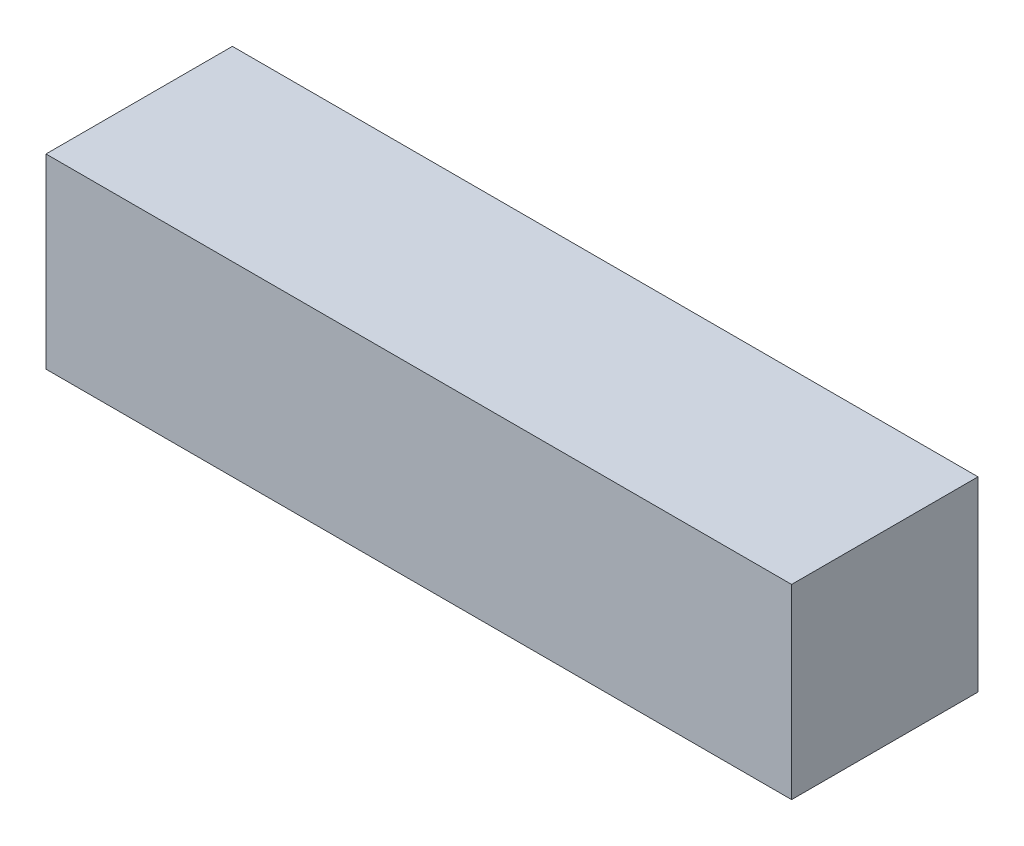
ISO-10303-21;
HEADER;
FILE_DESCRIPTION(('STEP AP214'),'2;1');
FILE_NAME('part.step','',(''),(''),'','','');
FILE_SCHEMA(('AUTOMOTIVE_DESIGN { 1 0 10303 214 1 1 1 1 }'));
ENDSEC;
DATA;
#1=APPLICATION_CONTEXT('core data for automotive mechanical design processes');
#2=APPLICATION_PROTOCOL_DEFINITION('international standard','automotive_design',2000,#1);
#3=PRODUCT_CONTEXT('',#1,'mechanical');
#4=PRODUCT('Part','Part','',(#3));
#5=PRODUCT_RELATED_PRODUCT_CATEGORY('part','',(#4));
#6=PRODUCT_DEFINITION_FORMATION('','',#4);
#7=PRODUCT_DEFINITION_CONTEXT('part definition',#1,'design');
#8=PRODUCT_DEFINITION('design','',#6,#7);
#9=PRODUCT_DEFINITION_SHAPE('','',#8);
#10=(LENGTH_UNIT() NAMED_UNIT(*) SI_UNIT(.MILLI.,.METRE.));
#11=(NAMED_UNIT(*) PLANE_ANGLE_UNIT() SI_UNIT($,.RADIAN.));
#12=(NAMED_UNIT(*) SI_UNIT($,.STERADIAN.) SOLID_ANGLE_UNIT());
#13=UNCERTAINTY_MEASURE_WITH_UNIT(LENGTH_MEASURE(1.E-05),#10,'distance_accuracy_value','');
#14=(GEOMETRIC_REPRESENTATION_CONTEXT(3) GLOBAL_UNCERTAINTY_ASSIGNED_CONTEXT((#13)) GLOBAL_UNIT_ASSIGNED_CONTEXT((#10,
#11,#12)) REPRESENTATION_CONTEXT('',''));
#15=CARTESIAN_POINT('',(0.,0.,0.));
#16=DIRECTION('',(0.,0.,1.));
#17=DIRECTION('',(1.,0.,0.));
#18=AXIS2_PLACEMENT_3D('',#15,#16,#17);
#19=CARTESIAN_POINT('',(19.05,4.7625,-4.7625));
#20=DIRECTION('',(0.,0.,1.));
#21=DIRECTION('',(-1.,0.,0.));
#22=AXIS2_PLACEMENT_3D('',#19,#20,#21);
#23=PLANE('',#22);
#24=DIRECTION('',(0.,-1.,0.));
#25=VECTOR('',#24,1.);
#26=CARTESIAN_POINT('',(-19.05,4.7625,-4.7625));
#27=LINE('',#26,#25);
#28=CARTESIAN_POINT('',(-19.05,4.7625,-4.7625));
#29=VERTEX_POINT('',#28);
#30=CARTESIAN_POINT('',(-19.05,-4.7625,-4.7625));
#31=VERTEX_POINT('',#30);
#32=EDGE_CURVE('E104',#29,#31,#27,.T.);
#33=ORIENTED_EDGE('',*,*,#32,.F.);
#34=DIRECTION('',(-1.,0.,0.));
#35=VECTOR('',#34,1.);
#36=CARTESIAN_POINT('',(19.05,4.7625,-4.7625));
#37=LINE('',#36,#35);
#38=CARTESIAN_POINT('',(19.05,4.7625,-4.7625));
#39=VERTEX_POINT('',#38);
#40=EDGE_CURVE('E103',#39,#29,#37,.T.);
#41=ORIENTED_EDGE('',*,*,#40,.F.);
#42=DIRECTION('',(0.,-1.,0.));
#43=VECTOR('',#42,1.);
#44=CARTESIAN_POINT('',(19.05,4.7625,-4.7625));
#45=LINE('',#44,#43);
#46=CARTESIAN_POINT('',(19.05,-4.7625,-4.7625));
#47=VERTEX_POINT('',#46);
#48=EDGE_CURVE('E98',#39,#47,#45,.T.);
#49=ORIENTED_EDGE('',*,*,#48,.T.);
#50=DIRECTION('',(-1.,0.,0.));
#51=VECTOR('',#50,1.);
#52=CARTESIAN_POINT('',(19.05,-4.7625,-4.7625));
#53=LINE('',#52,#51);
#54=EDGE_CURVE('E11',#47,#31,#53,.T.);
#55=ORIENTED_EDGE('',*,*,#54,.T.);
#56=EDGE_LOOP('',(#33,#41,#49,#55));
#57=FACE_BOUND('',#56,.T.);
#58=ADVANCED_FACE('F41',(#57),#23,.F.);
#59=CARTESIAN_POINT('',(19.05,-4.7625,-4.7625));
#60=DIRECTION('',(0.,1.,0.));
#61=DIRECTION('',(0.,0.,-1.));
#62=AXIS2_PLACEMENT_3D('',#59,#60,#61);
#63=PLANE('',#62);
#64=DIRECTION('',(0.,0.,1.));
#65=VECTOR('',#64,1.);
#66=CARTESIAN_POINT('',(-19.05,-4.7625,-4.7625));
#67=LINE('',#66,#65);
#68=CARTESIAN_POINT('',(-19.05,-4.7625,4.7625));
#69=VERTEX_POINT('',#68);
#70=EDGE_CURVE('E106',#31,#69,#67,.T.);
#71=ORIENTED_EDGE('',*,*,#70,.F.);
#72=ORIENTED_EDGE('',*,*,#54,.F.);
#73=DIRECTION('',(0.,0.,1.));
#74=VECTOR('',#73,1.);
#75=CARTESIAN_POINT('',(19.05,-4.7625,-4.7625));
#76=LINE('',#75,#74);
#77=CARTESIAN_POINT('',(19.05,-4.7625,4.7625));
#78=VERTEX_POINT('',#77);
#79=EDGE_CURVE('E82',#47,#78,#76,.T.);
#80=ORIENTED_EDGE('',*,*,#79,.T.);
#81=DIRECTION('',(-1.,0.,0.));
#82=VECTOR('',#81,1.);
#83=CARTESIAN_POINT('',(19.05,-4.7625,4.7625));
#84=LINE('',#83,#82);
#85=EDGE_CURVE('E49',#78,#69,#84,.T.);
#86=ORIENTED_EDGE('',*,*,#85,.T.);
#87=EDGE_LOOP('',(#71,#72,#80,#86));
#88=FACE_BOUND('',#87,.T.);
#89=ADVANCED_FACE('F96',(#88),#63,.F.);
#90=CARTESIAN_POINT('',(19.05,4.7625,4.7625));
#91=DIRECTION('',(0.,0.,-1.));
#92=DIRECTION('',(1.,0.,0.));
#93=AXIS2_PLACEMENT_3D('',#90,#91,#92);
#94=PLANE('',#93);
#95=DIRECTION('',(0.,1.,0.));
#96=VECTOR('',#95,1.);
#97=CARTESIAN_POINT('',(-19.05,4.7625,4.7625));
#98=LINE('',#97,#96);
#99=CARTESIAN_POINT('',(-19.05,4.7625,4.7625));
#100=VERTEX_POINT('',#99);
#101=EDGE_CURVE('E92',#69,#100,#98,.T.);
#102=ORIENTED_EDGE('',*,*,#101,.F.);
#103=ORIENTED_EDGE('',*,*,#85,.F.);
#104=DIRECTION('',(0.,1.,0.));
#105=VECTOR('',#104,1.);
#106=CARTESIAN_POINT('',(19.05,4.7625,4.7625));
#107=LINE('',#106,#105);
#108=CARTESIAN_POINT('',(19.05,4.7625,4.7625));
#109=VERTEX_POINT('',#108);
#110=EDGE_CURVE('E85',#78,#109,#107,.T.);
#111=ORIENTED_EDGE('',*,*,#110,.T.);
#112=DIRECTION('',(-1.,0.,0.));
#113=VECTOR('',#112,1.);
#114=CARTESIAN_POINT('',(19.05,4.7625,4.7625));
#115=LINE('',#114,#113);
#116=EDGE_CURVE('E95',#109,#100,#115,.T.);
#117=ORIENTED_EDGE('',*,*,#116,.T.);
#118=EDGE_LOOP('',(#102,#103,#111,#117));
#119=FACE_BOUND('',#118,.T.);
#120=ADVANCED_FACE('F91',(#119),#94,.F.);
#121=CARTESIAN_POINT('',(19.05,4.7625,-4.7625));
#122=DIRECTION('',(0.,-1.,0.));
#123=DIRECTION('',(0.,0.,1.));
#124=AXIS2_PLACEMENT_3D('',#121,#122,#123);
#125=PLANE('',#124);
#126=DIRECTION('',(0.,0.,-1.));
#127=VECTOR('',#126,1.);
#128=CARTESIAN_POINT('',(-19.05,4.7625,-4.7625));
#129=LINE('',#128,#127);
#130=EDGE_CURVE('E71',#100,#29,#129,.T.);
#131=ORIENTED_EDGE('',*,*,#130,.F.);
#132=ORIENTED_EDGE('',*,*,#116,.F.);
#133=DIRECTION('',(0.,0.,-1.));
#134=VECTOR('',#133,1.);
#135=CARTESIAN_POINT('',(19.05,4.7625,-4.7625));
#136=LINE('',#135,#134);
#137=EDGE_CURVE('E57',#109,#39,#136,.T.);
#138=ORIENTED_EDGE('',*,*,#137,.T.);
#139=ORIENTED_EDGE('',*,*,#40,.T.);
#140=EDGE_LOOP('',(#131,#132,#138,#139));
#141=FACE_BOUND('',#140,.T.);
#142=ADVANCED_FACE('F115',(#141),#125,.F.);
#143=CARTESIAN_POINT('',(19.05,0.,0.));
#144=DIRECTION('',(1.,0.,0.));
#145=DIRECTION('',(0.,0.,1.));
#146=AXIS2_PLACEMENT_3D('',#143,#144,#145);
#147=PLANE('',#146);
#148=ORIENTED_EDGE('',*,*,#48,.F.);
#149=ORIENTED_EDGE('',*,*,#137,.F.);
#150=ORIENTED_EDGE('',*,*,#110,.F.);
#151=ORIENTED_EDGE('',*,*,#79,.F.);
#152=EDGE_LOOP('',(#148,#149,#150,#151));
#153=FACE_BOUND('',#152,.T.);
#154=ADVANCED_FACE('F87',(#153),#147,.T.);
#155=CARTESIAN_POINT('',(-19.05,0.,0.));
#156=DIRECTION('',(1.,0.,0.));
#157=DIRECTION('',(0.,0.,1.));
#158=AXIS2_PLACEMENT_3D('',#155,#156,#157);
#159=PLANE('',#158);
#160=ORIENTED_EDGE('',*,*,#32,.T.);
#161=ORIENTED_EDGE('',*,*,#70,.T.);
#162=ORIENTED_EDGE('',*,*,#101,.T.);
#163=ORIENTED_EDGE('',*,*,#130,.T.);
#164=EDGE_LOOP('',(#160,#161,#162,#163));
#165=FACE_BOUND('',#164,.T.);
#166=ADVANCED_FACE('F111',(#165),#159,.F.);
#167=CLOSED_SHELL('',(#58,#89,#120,#142,#154,#166));
#168=MANIFOLD_SOLID_BREP('B2',#167);
#169=ADVANCED_BREP_SHAPE_REPRESENTATION('',(#18,#168),#14);
#170=SHAPE_DEFINITION_REPRESENTATION(#9,#169);
ENDSEC;
END-ISO-10303-21;
